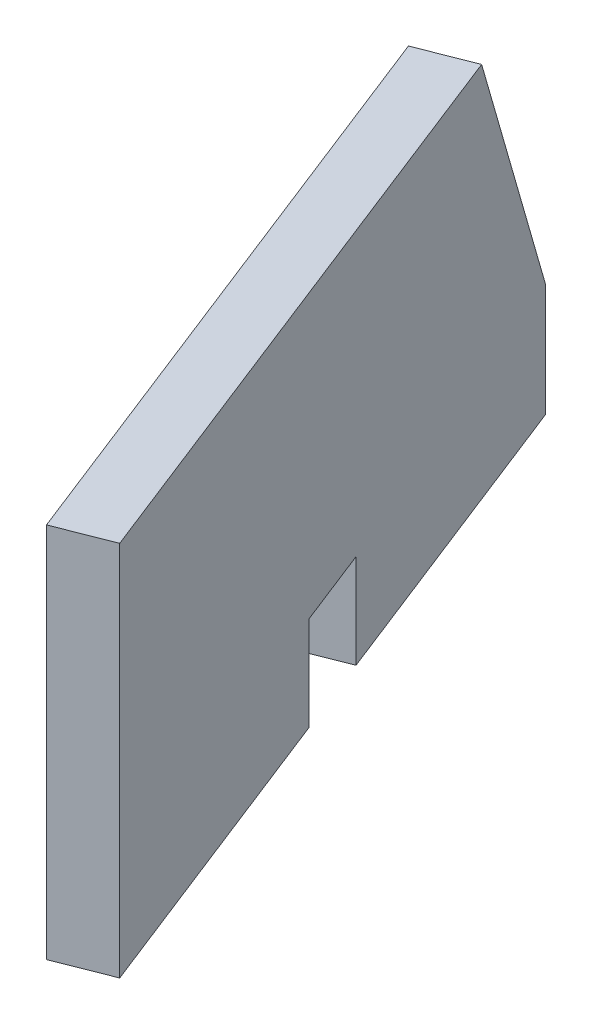
ISO-10303-21;
HEADER;
FILE_DESCRIPTION(('STEP AP214'),'2;1');
FILE_NAME('part.step','',(''),(''),'','','');
FILE_SCHEMA(('AUTOMOTIVE_DESIGN { 1 0 10303 214 1 1 1 1 }'));
ENDSEC;
DATA;
#1=APPLICATION_CONTEXT('core data for automotive mechanical design processes');
#2=APPLICATION_PROTOCOL_DEFINITION('international standard','automotive_design',2000,#1);
#3=PRODUCT_CONTEXT('',#1,'mechanical');
#4=PRODUCT('Part','Part','',(#3));
#5=PRODUCT_RELATED_PRODUCT_CATEGORY('part','',(#4));
#6=PRODUCT_DEFINITION_FORMATION('','',#4);
#7=PRODUCT_DEFINITION_CONTEXT('part definition',#1,'design');
#8=PRODUCT_DEFINITION('design','',#6,#7);
#9=PRODUCT_DEFINITION_SHAPE('','',#8);
#10=(LENGTH_UNIT() NAMED_UNIT(*) SI_UNIT(.MILLI.,.METRE.));
#11=(NAMED_UNIT(*) PLANE_ANGLE_UNIT() SI_UNIT($,.RADIAN.));
#12=(NAMED_UNIT(*) SI_UNIT($,.STERADIAN.) SOLID_ANGLE_UNIT());
#13=UNCERTAINTY_MEASURE_WITH_UNIT(LENGTH_MEASURE(1.E-05),#10,'distance_accuracy_value','');
#14=(GEOMETRIC_REPRESENTATION_CONTEXT(3) GLOBAL_UNCERTAINTY_ASSIGNED_CONTEXT((#13)) GLOBAL_UNIT_ASSIGNED_CONTEXT((#10,
#11,#12)) REPRESENTATION_CONTEXT('',''));
#15=CARTESIAN_POINT('',(0.,0.,0.));
#16=DIRECTION('',(0.,0.,1.));
#17=DIRECTION('',(1.,0.,0.));
#18=AXIS2_PLACEMENT_3D('',#15,#16,#17);
#19=CARTESIAN_POINT('',(29.5486600845325,199.999999999968,95.8286318758756));
#20=DIRECTION('',(2.54476995031894E-13,0.999999999999987,0.));
#21=DIRECTION('',(-0.930888575458371,3.07656677911439E-13,0.365303244005644));
#22=AXIS2_PLACEMENT_3D('',#19,#20,#21);
#23=PLANE('',#22);
#24=DIRECTION('',(-0.365303244005644,0.,-0.930888575458372));
#25=VECTOR('',#24,1.);
#26=CARTESIAN_POINT('',(43.5119887164109,199.999999999961,90.3490832157898));
#27=LINE('',#26,#25);
#28=CARTESIAN_POINT('',(2.96332863177967,199.999999999975,-12.9795486600873));
#29=VERTEX_POINT('',#28);
#30=CARTESIAN_POINT('',(-29.548660084722,199.999999999977,-95.8286318758839));
#31=VERTEX_POINT('',#30);
#32=EDGE_CURVE('E49',#29,#31,#27,.T.);
#33=ORIENTED_EDGE('',*,*,#32,.F.);
#34=DIRECTION('',(-0.930888575458371,3.07656677911439E-13,0.365303244005644));
#35=VECTOR('',#34,1.);
#36=CARTESIAN_POINT('',(2.96332863177967,199.999999999975,-12.9795486600873));
#37=LINE('',#36,#35);
#38=CARTESIAN_POINT('',(-11.0000000000877,199.999999999972,-7.50000000000361));
#39=VERTEX_POINT('',#38);
#40=EDGE_CURVE('E169',#29,#39,#37,.T.);
#41=ORIENTED_EDGE('',*,*,#40,.T.);
#42=DIRECTION('',(-0.365303244005644,0.,-0.930888575458372));
#43=VECTOR('',#42,1.);
#44=CARTESIAN_POINT('',(29.5486600845325,199.999999999968,95.8286318758756));
#45=LINE('',#44,#43);
#46=CARTESIAN_POINT('',(-43.5119887165955,199.999999999979,-90.3490832157975));
#47=VERTEX_POINT('',#46);
#48=EDGE_CURVE('E146',#39,#47,#45,.T.);
#49=ORIENTED_EDGE('',*,*,#48,.T.);
#50=DIRECTION('',(0.930888575458371,-3.07656677911439E-13,-0.365303244005644));
#51=VECTOR('',#50,1.);
#52=CARTESIAN_POINT('',(-43.5119887165955,199.999999999979,-90.3490832157975));
#53=LINE('',#52,#51);
#54=EDGE_CURVE('E153',#47,#31,#53,.T.);
#55=ORIENTED_EDGE('',*,*,#54,.T.);
#56=EDGE_LOOP('',(#33,#41,#49,#55));
#57=FACE_BOUND('',#56,.T.);
#58=ADVANCED_FACE('F40',(#57),#23,.F.);
#59=CARTESIAN_POINT('',(29.5486600845325,199.999999999968,95.8286318758756));
#60=VERTEX_POINT('',#59);
#61=CARTESIAN_POINT('',(-2.96332863197046,199.999999999972,12.9795486600812));
#62=VERTEX_POINT('',#61);
#63=EDGE_CURVE('E140',#60,#62,#45,.T.);
#64=ORIENTED_EDGE('',*,*,#63,.T.);
#65=DIRECTION('',(-0.930888575458371,3.07656677911439E-13,0.365303244005644));
#66=VECTOR('',#65,1.);
#67=CARTESIAN_POINT('',(10.9999999999066,199.999999999973,7.49999999999706));
#68=LINE('',#67,#66);
#69=CARTESIAN_POINT('',(10.9999999999066,199.999999999973,7.49999999999706));
#70=VERTEX_POINT('',#69);
#71=EDGE_CURVE('E64',#70,#62,#68,.T.);
#72=ORIENTED_EDGE('',*,*,#71,.F.);
#73=CARTESIAN_POINT('',(43.5119887164109,199.999999999961,90.3490832157898));
#74=VERTEX_POINT('',#73);
#75=EDGE_CURVE('E11',#74,#70,#27,.T.);
#76=ORIENTED_EDGE('',*,*,#75,.F.);
#77=DIRECTION('',(0.930888575458371,-3.07656677911439E-13,-0.365303244005644));
#78=VECTOR('',#77,1.);
#79=CARTESIAN_POINT('',(29.5486600845325,199.999999999968,95.8286318758756));
#80=LINE('',#79,#78);
#81=EDGE_CURVE('E150',#60,#74,#80,.T.);
#82=ORIENTED_EDGE('',*,*,#81,.F.);
#83=EDGE_LOOP('',(#64,#72,#76,#82));
#84=FACE_BOUND('',#83,.T.);
#85=ADVANCED_FACE('F42',(#84),#23,.F.);
#86=CARTESIAN_POINT('',(43.5119887164109,199.999999999961,90.3490832157898));
#87=DIRECTION('',(-0.930888575458371,3.07656677911439E-13,0.365303244005644));
#88=DIRECTION('',(0.365303244005644,0.,0.930888575458372));
#89=AXIS2_PLACEMENT_3D('',#86,#87,#88);
#90=PLANE('',#89);
#91=DIRECTION('',(2.54476995031894E-13,0.999999999999987,0.));
#92=VECTOR('',#91,1.);
#93=CARTESIAN_POINT('',(-29.548660084722,199.999999999977,-95.8286318758839));
#94=LINE('',#93,#92);
#95=CARTESIAN_POINT('',(-29.5486600847135,229.999999999976,-95.8286318758859));
#96=VERTEX_POINT('',#95);
#97=EDGE_CURVE('E130',#31,#96,#94,.T.);
#98=ORIENTED_EDGE('',*,*,#97,.T.);
#99=DIRECTION('',(0.143899997647631,0.919145030018045,0.366694974699833));
#100=VECTOR('',#99,1.);
#101=CARTESIAN_POINT('',(-29.5486600847135,229.999999999976,-95.8286318758859));
#102=LINE('',#101,#100);
#103=CARTESIAN_POINT('',(-18.5895627645237,299.999999999971,-67.9019746121406));
#104=VERTEX_POINT('',#103);
#105=EDGE_CURVE('E56',#96,#104,#102,.T.);
#106=ORIENTED_EDGE('',*,*,#105,.T.);
#107=DIRECTION('',(-0.365303244005644,0.,-0.930888575458372));
#108=VECTOR('',#107,1.);
#109=CARTESIAN_POINT('',(43.511988716434,299.999999999966,90.3490832157827));
#110=LINE('',#109,#108);
#111=CARTESIAN_POINT('',(43.511988716434,299.999999999966,90.3490832157827));
#112=VERTEX_POINT('',#111);
#113=EDGE_CURVE('E127',#112,#104,#110,.T.);
#114=ORIENTED_EDGE('',*,*,#113,.F.);
#115=DIRECTION('',(2.54476995031894E-13,0.999999999999987,0.));
#116=VECTOR('',#115,1.);
#117=CARTESIAN_POINT('',(43.5119887164109,199.999999999961,90.3490832157898));
#118=LINE('',#117,#116);
#119=EDGE_CURVE('E163',#74,#112,#118,.T.);
#120=ORIENTED_EDGE('',*,*,#119,.F.);
#121=ORIENTED_EDGE('',*,*,#75,.T.);
#122=DIRECTION('',(2.54532506183125E-13,0.999999999999987,0.));
#123=VECTOR('',#122,1.);
#124=CARTESIAN_POINT('',(10.9999999999066,199.999999999973,7.49999999999706));
#125=LINE('',#124,#123);
#126=CARTESIAN_POINT('',(10.999999999905,224.999999999966,7.49999999999584));
#127=VERTEX_POINT('',#126);
#128=EDGE_CURVE('E194',#70,#127,#125,.T.);
#129=ORIENTED_EDGE('',*,*,#128,.T.);
#130=DIRECTION('',(-0.365303244005644,0.,-0.930888575458372));
#131=VECTOR('',#130,1.);
#132=CARTESIAN_POINT('',(2.96332863178667,224.999999999971,-12.9795486600891));
#133=LINE('',#132,#131);
#134=CARTESIAN_POINT('',(2.96332863178667,224.999999999971,-12.9795486600891));
#135=VERTEX_POINT('',#134);
#136=EDGE_CURVE('E173',#127,#135,#133,.T.);
#137=ORIENTED_EDGE('',*,*,#136,.T.);
#138=DIRECTION('',(-2.54476995031894E-13,-0.999999999999987,0.));
#139=VECTOR('',#138,1.);
#140=CARTESIAN_POINT('',(2.96332863177967,199.999999999975,-12.9795486600873));
#141=LINE('',#140,#139);
#142=EDGE_CURVE('E185',#135,#29,#141,.T.);
#143=ORIENTED_EDGE('',*,*,#142,.T.);
#144=ORIENTED_EDGE('',*,*,#32,.T.);
#145=EDGE_LOOP('',(#98,#106,#114,#120,#121,#129,#137,#143,#144));
#146=FACE_BOUND('',#145,.T.);
#147=ADVANCED_FACE('F126',(#146),#90,.F.);
#148=CARTESIAN_POINT('',(29.548660084554,299.99999999997,95.8286318758708));
#149=DIRECTION('',(-2.54476995031894E-13,-0.999999999999987,0.));
#150=DIRECTION('',(0.930888575458371,-3.07656677911439E-13,-0.365303244005644));
#151=AXIS2_PLACEMENT_3D('',#148,#149,#150);
#152=PLANE('',#151);
#153=ORIENTED_EDGE('',*,*,#113,.T.);
#154=DIRECTION('',(-0.930888575458371,3.07656677911439E-13,0.365303244005644));
#155=VECTOR('',#154,1.);
#156=CARTESIAN_POINT('',(-18.5895627645237,299.999999999971,-67.9019746121406));
#157=LINE('',#156,#155);
#158=CARTESIAN_POINT('',(-32.5528913963993,299.999999999975,-62.4224259520565));
#159=VERTEX_POINT('',#158);
#160=EDGE_CURVE('E111',#104,#159,#157,.T.);
#161=ORIENTED_EDGE('',*,*,#160,.T.);
#162=DIRECTION('',(-0.365303244005644,0.,-0.930888575458372));
#163=VECTOR('',#162,1.);
#164=CARTESIAN_POINT('',(29.548660084554,299.99999999997,95.8286318758708));
#165=LINE('',#164,#163);
#166=CARTESIAN_POINT('',(29.548660084554,299.99999999997,95.8286318758708));
#167=VERTEX_POINT('',#166);
#168=EDGE_CURVE('E136',#167,#159,#165,.T.);
#169=ORIENTED_EDGE('',*,*,#168,.F.);
#170=DIRECTION('',(-0.930888575458371,3.07656677911439E-13,0.365303244005644));
#171=VECTOR('',#170,1.);
#172=CARTESIAN_POINT('',(29.548660084554,299.99999999997,95.8286318758708));
#173=LINE('',#172,#171);
#174=EDGE_CURVE('E134',#112,#167,#173,.T.);
#175=ORIENTED_EDGE('',*,*,#174,.F.);
#176=EDGE_LOOP('',(#153,#161,#169,#175));
#177=FACE_BOUND('',#176,.T.);
#178=ADVANCED_FACE('F133',(#177),#152,.F.);
#179=CARTESIAN_POINT('',(29.5486600845325,199.999999999968,95.8286318758756));
#180=DIRECTION('',(0.930888575458371,-3.07656677911439E-13,-0.365303244005644));
#181=DIRECTION('',(-0.365303244005644,0.,-0.930888575458372));
#182=AXIS2_PLACEMENT_3D('',#179,#180,#181);
#183=PLANE('',#182);
#184=ORIENTED_EDGE('',*,*,#168,.T.);
#185=DIRECTION('',(0.143899997647631,0.919145030018045,0.366694974699833));
#186=VECTOR('',#185,1.);
#187=CARTESIAN_POINT('',(-43.5119887165891,229.999999999974,-90.3490832158049));
#188=LINE('',#187,#186);
#189=CARTESIAN_POINT('',(-43.5119887165891,229.999999999974,-90.3490832158049));
#190=VERTEX_POINT('',#189);
#191=EDGE_CURVE('E114',#190,#159,#188,.T.);
#192=ORIENTED_EDGE('',*,*,#191,.F.);
#193=DIRECTION('',(-2.54476995031894E-13,-0.999999999999987,0.));
#194=VECTOR('',#193,1.);
#195=CARTESIAN_POINT('',(-43.5119887165955,199.999999999979,-90.3490832157975));
#196=LINE('',#195,#194);
#197=EDGE_CURVE('E147',#190,#47,#196,.T.);
#198=ORIENTED_EDGE('',*,*,#197,.T.);
#199=ORIENTED_EDGE('',*,*,#48,.F.);
#200=DIRECTION('',(-2.54476995031894E-13,-0.999999999999987,0.));
#201=VECTOR('',#200,1.);
#202=CARTESIAN_POINT('',(-11.0000000000877,199.999999999972,-7.50000000000361));
#203=LINE('',#202,#201);
#204=CARTESIAN_POINT('',(-11.0000000000873,224.999999999975,-7.50000000000473));
#205=VERTEX_POINT('',#204);
#206=EDGE_CURVE('E120',#205,#39,#203,.T.);
#207=ORIENTED_EDGE('',*,*,#206,.F.);
#208=DIRECTION('',(-0.365303244005644,0.,-0.930888575458372));
#209=VECTOR('',#208,1.);
#210=CARTESIAN_POINT('',(-11.0000000000873,224.999999999975,-7.50000000000473));
#211=LINE('',#210,#209);
#212=CARTESIAN_POINT('',(-2.96332863196208,224.99999999997,12.9795486600786));
#213=VERTEX_POINT('',#212);
#214=EDGE_CURVE('E181',#213,#205,#211,.T.);
#215=ORIENTED_EDGE('',*,*,#214,.F.);
#216=DIRECTION('',(2.54532506183125E-13,0.999999999999987,0.));
#217=VECTOR('',#216,1.);
#218=CARTESIAN_POINT('',(-2.96332863197046,199.999999999972,12.9795486600812));
#219=LINE('',#218,#217);
#220=EDGE_CURVE('E186',#62,#213,#219,.T.);
#221=ORIENTED_EDGE('',*,*,#220,.F.);
#222=ORIENTED_EDGE('',*,*,#63,.F.);
#223=DIRECTION('',(-2.54476995031894E-13,-0.999999999999987,0.));
#224=VECTOR('',#223,1.);
#225=CARTESIAN_POINT('',(29.5486600845325,199.999999999968,95.8286318758756));
#226=LINE('',#225,#224);
#227=EDGE_CURVE('E158',#167,#60,#226,.T.);
#228=ORIENTED_EDGE('',*,*,#227,.F.);
#229=EDGE_LOOP('',(#184,#192,#198,#199,#207,#215,#221,#222,#228));
#230=FACE_BOUND('',#229,.T.);
#231=ADVANCED_FACE('F218',(#230),#183,.F.);
#232=CARTESIAN_POINT('',(43.5119887164109,199.999999999961,90.3490832157898));
#233=DIRECTION('',(0.365303244005644,0.,0.930888575458372));
#234=DIRECTION('',(0.930888575458371,-3.07656677911439E-13,-0.365303244005644));
#235=AXIS2_PLACEMENT_3D('',#232,#233,#234);
#236=PLANE('',#235);
#237=ORIENTED_EDGE('',*,*,#81,.T.);
#238=ORIENTED_EDGE('',*,*,#119,.T.);
#239=ORIENTED_EDGE('',*,*,#174,.T.);
#240=ORIENTED_EDGE('',*,*,#227,.T.);
#241=EDGE_LOOP('',(#237,#238,#239,#240));
#242=FACE_BOUND('',#241,.T.);
#243=ADVANCED_FACE('F223',(#242),#236,.T.);
#244=CARTESIAN_POINT('',(-29.548660084722,199.999999999977,-95.8286318758839));
#245=DIRECTION('',(0.365303244005644,0.,0.930888575458372));
#246=DIRECTION('',(0.930888575458371,-3.07656677911439E-13,-0.365303244005644));
#247=AXIS2_PLACEMENT_3D('',#244,#245,#246);
#248=PLANE('',#247);
#249=ORIENTED_EDGE('',*,*,#197,.F.);
#250=DIRECTION('',(-0.930888575458371,3.07656677911439E-13,0.365303244005644));
#251=VECTOR('',#250,1.);
#252=CARTESIAN_POINT('',(-29.5486600847135,229.999999999976,-95.8286318758859));
#253=LINE('',#252,#251);
#254=EDGE_CURVE('E121',#96,#190,#253,.T.);
#255=ORIENTED_EDGE('',*,*,#254,.F.);
#256=ORIENTED_EDGE('',*,*,#97,.F.);
#257=ORIENTED_EDGE('',*,*,#54,.F.);
#258=EDGE_LOOP('',(#249,#255,#256,#257));
#259=FACE_BOUND('',#258,.T.);
#260=ADVANCED_FACE('F217',(#259),#248,.F.);
#261=CARTESIAN_POINT('',(2.96332863177967,199.999999999975,-12.9795486600873));
#262=DIRECTION('',(-0.365303244005644,0.,-0.930888575458372));
#263=DIRECTION('',(-0.930888575458371,3.07656677911439E-13,0.365303244005644));
#264=AXIS2_PLACEMENT_3D('',#261,#262,#263);
#265=PLANE('',#264);
#266=ORIENTED_EDGE('',*,*,#206,.T.);
#267=ORIENTED_EDGE('',*,*,#40,.F.);
#268=ORIENTED_EDGE('',*,*,#142,.F.);
#269=DIRECTION('',(-0.930888575458371,3.07656677911439E-13,0.365303244005644));
#270=VECTOR('',#269,1.);
#271=CARTESIAN_POINT('',(2.96332863178667,224.999999999971,-12.9795486600891));
#272=LINE('',#271,#270);
#273=EDGE_CURVE('E157',#135,#205,#272,.T.);
#274=ORIENTED_EDGE('',*,*,#273,.T.);
#275=EDGE_LOOP('',(#266,#267,#268,#274));
#276=FACE_BOUND('',#275,.T.);
#277=ADVANCED_FACE('F283',(#276),#265,.F.);
#278=CARTESIAN_POINT('',(2.96332863178667,224.999999999971,-12.9795486600891));
#279=DIRECTION('',(2.54476995031894E-13,0.999999999999987,0.));
#280=DIRECTION('',(-0.930888575458371,3.07656677911439E-13,0.365303244005644));
#281=AXIS2_PLACEMENT_3D('',#278,#279,#280);
#282=PLANE('',#281);
#283=ORIENTED_EDGE('',*,*,#214,.T.);
#284=ORIENTED_EDGE('',*,*,#273,.F.);
#285=ORIENTED_EDGE('',*,*,#136,.F.);
#286=DIRECTION('',(-0.930888575458371,3.07656677911439E-13,0.365303244005644));
#287=VECTOR('',#286,1.);
#288=CARTESIAN_POINT('',(10.999999999905,224.999999999966,7.49999999999584));
#289=LINE('',#288,#287);
#290=EDGE_CURVE('E176',#127,#213,#289,.T.);
#291=ORIENTED_EDGE('',*,*,#290,.T.);
#292=EDGE_LOOP('',(#283,#284,#285,#291));
#293=FACE_BOUND('',#292,.T.);
#294=ADVANCED_FACE('F293',(#293),#282,.F.);
#295=CARTESIAN_POINT('',(10.9999999999066,199.999999999973,7.49999999999706));
#296=DIRECTION('',(0.365303244005641,0.,0.930888575458369));
#297=DIRECTION('',(2.54532506183125E-13,0.999999999999987,0.));
#298=AXIS2_PLACEMENT_3D('',#295,#296,#297);
#299=PLANE('',#298);
#300=ORIENTED_EDGE('',*,*,#220,.T.);
#301=ORIENTED_EDGE('',*,*,#290,.F.);
#302=ORIENTED_EDGE('',*,*,#128,.F.);
#303=ORIENTED_EDGE('',*,*,#71,.T.);
#304=EDGE_LOOP('',(#300,#301,#302,#303));
#305=FACE_BOUND('',#304,.T.);
#306=ADVANCED_FACE('F304',(#305),#299,.F.);
#307=CARTESIAN_POINT('',(-29.5486600847135,229.999999999976,-95.8286318758859));
#308=DIRECTION('',(0.335766661177163,-0.39391929857917,0.855621607633188));
#309=DIRECTION('',(0.143899997647631,0.919145030018045,0.366694974699833));
#310=AXIS2_PLACEMENT_3D('',#307,#308,#309);
#311=PLANE('',#310);
#312=ORIENTED_EDGE('',*,*,#191,.T.);
#313=ORIENTED_EDGE('',*,*,#160,.F.);
#314=ORIENTED_EDGE('',*,*,#105,.F.);
#315=ORIENTED_EDGE('',*,*,#254,.T.);
#316=EDGE_LOOP('',(#312,#313,#314,#315));
#317=FACE_BOUND('',#316,.T.);
#318=ADVANCED_FACE('F112',(#317),#311,.F.);
#319=CLOSED_SHELL('',(#58,#85,#147,#178,#231,#243,#260,#277,#294,#306,#318));
#320=MANIFOLD_SOLID_BREP('B2',#319);
#321=ADVANCED_BREP_SHAPE_REPRESENTATION('',(#18,#320),#14);
#322=SHAPE_DEFINITION_REPRESENTATION(#9,#321);
ENDSEC;
END-ISO-10303-21;
